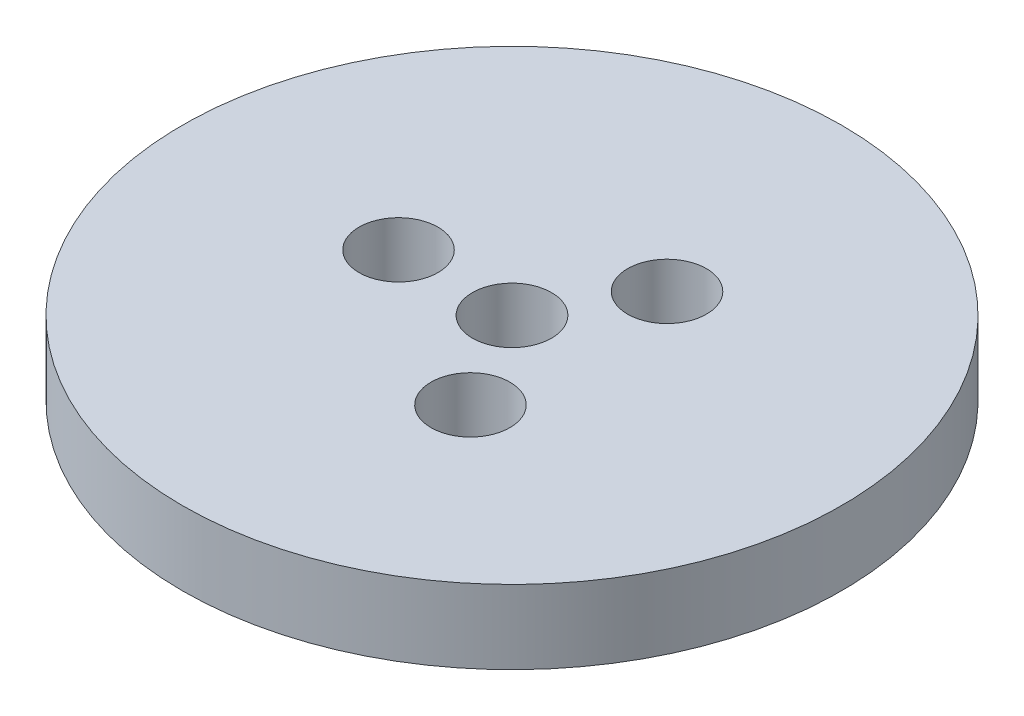
ISO-10303-21;
HEADER;
FILE_DESCRIPTION(('STEP AP214'),'2;1');
FILE_NAME('part.step','',(''),(''),'','','');
FILE_SCHEMA(('AUTOMOTIVE_DESIGN { 1 0 10303 214 1 1 1 1 }'));
ENDSEC;
DATA;
#1=APPLICATION_CONTEXT('core data for automotive mechanical design processes');
#2=APPLICATION_PROTOCOL_DEFINITION('international standard','automotive_design',2000,#1);
#3=PRODUCT_CONTEXT('',#1,'mechanical');
#4=PRODUCT('Part','Part','',(#3));
#5=PRODUCT_RELATED_PRODUCT_CATEGORY('part','',(#4));
#6=PRODUCT_DEFINITION_FORMATION('','',#4);
#7=PRODUCT_DEFINITION_CONTEXT('part definition',#1,'design');
#8=PRODUCT_DEFINITION('design','',#6,#7);
#9=PRODUCT_DEFINITION_SHAPE('','',#8);
#10=(LENGTH_UNIT() NAMED_UNIT(*) SI_UNIT(.MILLI.,.METRE.));
#11=(NAMED_UNIT(*) PLANE_ANGLE_UNIT() SI_UNIT($,.RADIAN.));
#12=(NAMED_UNIT(*) SI_UNIT($,.STERADIAN.) SOLID_ANGLE_UNIT());
#13=UNCERTAINTY_MEASURE_WITH_UNIT(LENGTH_MEASURE(1.E-05),#10,'distance_accuracy_value','');
#14=(GEOMETRIC_REPRESENTATION_CONTEXT(3) GLOBAL_UNCERTAINTY_ASSIGNED_CONTEXT((#13)) GLOBAL_UNIT_ASSIGNED_CONTEXT((#10,
#11,#12)) REPRESENTATION_CONTEXT('',''));
#15=CARTESIAN_POINT('',(0.,0.,0.));
#16=DIRECTION('',(0.,0.,1.));
#17=DIRECTION('',(1.,0.,0.));
#18=AXIS2_PLACEMENT_3D('',#15,#16,#17);
#19=CARTESIAN_POINT('',(0.,14.,0.));
#20=DIRECTION('',(0.,-1.,0.));
#21=DIRECTION('',(0.,0.,-1.));
#22=AXIS2_PLACEMENT_3D('',#19,#20,#21);
#23=CYLINDRICAL_SURFACE('',#22,62.5);
#24=CARTESIAN_POINT('',(0.,14.,0.));
#25=DIRECTION('',(0.,1.,0.));
#26=DIRECTION('',(0.,0.,1.));
#27=AXIS2_PLACEMENT_3D('',#24,#25,#26);
#28=CIRCLE('',#27,62.5);
#29=CARTESIAN_POINT('',(0.,14.,62.5));
#30=VERTEX_POINT('',#29);
#31=EDGE_CURVE('E10',#30,#30,#28,.T.);
#32=ORIENTED_EDGE('',*,*,#31,.F.);
#33=EDGE_LOOP('',(#32));
#34=FACE_BOUND('',#33,.T.);
#35=CARTESIAN_POINT('',(0.,0.,0.));
#36=DIRECTION('',(0.,1.,0.));
#37=DIRECTION('',(0.,0.,1.));
#38=AXIS2_PLACEMENT_3D('',#35,#36,#37);
#39=CIRCLE('',#38,62.5);
#40=CARTESIAN_POINT('',(0.,0.,62.5));
#41=VERTEX_POINT('',#40);
#42=EDGE_CURVE('E37',#41,#41,#39,.T.);
#43=ORIENTED_EDGE('',*,*,#42,.T.);
#44=EDGE_LOOP('',(#43));
#45=FACE_BOUND('',#44,.T.);
#46=ADVANCED_FACE('F40',(#34,#45),#23,.T.);
#47=CARTESIAN_POINT('',(0.,14.,0.));
#48=DIRECTION('',(0.,1.,0.));
#49=DIRECTION('',(0.,0.,1.));
#50=AXIS2_PLACEMENT_3D('',#47,#48,#49);
#51=PLANE('',#50);
#52=CARTESIAN_POINT('',(10.7622114513418,14.,18.6406970355233));
#53=DIRECTION('',(0.,1.,0.));
#54=DIRECTION('',(0.866025403784436,0.,-0.500000000000004));
#55=AXIS2_PLACEMENT_3D('',#52,#53,#54);
#56=CIRCLE('',#55,7.48312621691386);
#57=CARTESIAN_POINT('',(10.7622114513418,14.,26.1238232524372));
#58=VERTEX_POINT('',#57);
#59=EDGE_CURVE('E70',#58,#58,#56,.T.);
#60=ORIENTED_EDGE('',*,*,#59,.F.);
#61=EDGE_LOOP('',(#60));
#62=FACE_BOUND('',#61,.T.);
#63=CARTESIAN_POINT('',(10.7622114513415,14.,-18.6406970355235));
#64=DIRECTION('',(0.,1.,0.));
#65=DIRECTION('',(-0.866025403784443,0.,-0.499999999999992));
#66=AXIS2_PLACEMENT_3D('',#63,#64,#65);
#67=CIRCLE('',#66,7.48312621691386);
#68=CARTESIAN_POINT('',(10.7622114513415,14.,-11.1575708186096));
#69=VERTEX_POINT('',#68);
#70=EDGE_CURVE('E61',#69,#69,#67,.T.);
#71=ORIENTED_EDGE('',*,*,#70,.F.);
#72=EDGE_LOOP('',(#71));
#73=FACE_BOUND('',#72,.T.);
#74=CARTESIAN_POINT('',(-21.5244229026834,14.,0.));
#75=DIRECTION('',(0.,1.,0.));
#76=DIRECTION('',(0.,0.,1.));
#77=AXIS2_PLACEMENT_3D('',#74,#75,#76);
#78=CIRCLE('',#77,7.48312621691386);
#79=CARTESIAN_POINT('',(-21.5244229026834,14.,7.48312621691386));
#80=VERTEX_POINT('',#79);
#81=EDGE_CURVE('E54',#80,#80,#78,.T.);
#82=ORIENTED_EDGE('',*,*,#81,.F.);
#83=EDGE_LOOP('',(#82));
#84=FACE_BOUND('',#83,.T.);
#85=CARTESIAN_POINT('',(0.,14.,0.));
#86=DIRECTION('',(0.,1.,0.));
#87=DIRECTION('',(0.,0.,1.));
#88=AXIS2_PLACEMENT_3D('',#85,#86,#87);
#89=CIRCLE('',#88,7.5);
#90=CARTESIAN_POINT('',(0.,14.,7.5));
#91=VERTEX_POINT('',#90);
#92=EDGE_CURVE('E50',#91,#91,#89,.T.);
#93=ORIENTED_EDGE('',*,*,#92,.F.);
#94=EDGE_LOOP('',(#93));
#95=FACE_BOUND('',#94,.T.);
#96=ORIENTED_EDGE('',*,*,#31,.T.);
#97=EDGE_LOOP('',(#96));
#98=FACE_BOUND('',#97,.T.);
#99=ADVANCED_FACE('F85',(#62,#73,#84,#95,#98),#51,.T.);
#100=CARTESIAN_POINT('',(0.,0.,0.));
#101=DIRECTION('',(0.,1.,0.));
#102=DIRECTION('',(0.,0.,1.));
#103=AXIS2_PLACEMENT_3D('',#100,#101,#102);
#104=PLANE('',#103);
#105=CARTESIAN_POINT('',(0.,0.,0.));
#106=DIRECTION('',(0.,1.,0.));
#107=DIRECTION('',(0.,0.,1.));
#108=AXIS2_PLACEMENT_3D('',#105,#106,#107);
#109=CIRCLE('',#108,7.5);
#110=CARTESIAN_POINT('',(0.,0.,7.5));
#111=VERTEX_POINT('',#110);
#112=EDGE_CURVE('E47',#111,#111,#109,.T.);
#113=ORIENTED_EDGE('',*,*,#112,.T.);
#114=EDGE_LOOP('',(#113));
#115=FACE_BOUND('',#114,.T.);
#116=ORIENTED_EDGE('',*,*,#42,.F.);
#117=EDGE_LOOP('',(#116));
#118=FACE_BOUND('',#117,.T.);
#119=ADVANCED_FACE('F84',(#115,#118),#104,.F.);
#120=CARTESIAN_POINT('',(0.,14.,0.));
#121=DIRECTION('',(0.,-1.,0.));
#122=DIRECTION('',(0.,0.,-1.));
#123=AXIS2_PLACEMENT_3D('',#120,#121,#122);
#124=CYLINDRICAL_SURFACE('',#123,7.5);
#125=ORIENTED_EDGE('',*,*,#92,.T.);
#126=EDGE_LOOP('',(#125));
#127=FACE_BOUND('',#126,.T.);
#128=ORIENTED_EDGE('',*,*,#112,.F.);
#129=EDGE_LOOP('',(#128));
#130=FACE_BOUND('',#129,.T.);
#131=ADVANCED_FACE('F91',(#127,#130),#124,.F.);
#132=CARTESIAN_POINT('',(-21.5244229026834,0.99956611912721,0.));
#133=DIRECTION('',(0.,1.,0.));
#134=DIRECTION('',(0.,0.,1.));
#135=AXIS2_PLACEMENT_3D('',#132,#133,#134);
#136=CYLINDRICAL_SURFACE('',#135,7.48312621691386);
#137=CARTESIAN_POINT('',(-21.5244229026834,0.99956611912721,0.));
#138=DIRECTION('',(0.,1.,0.));
#139=DIRECTION('',(0.,0.,1.));
#140=AXIS2_PLACEMENT_3D('',#137,#138,#139);
#141=CIRCLE('',#140,7.48312621691386);
#142=CARTESIAN_POINT('',(-21.5244229026834,0.99956611912721,7.48312621691386));
#143=VERTEX_POINT('',#142);
#144=EDGE_CURVE('E55',#143,#143,#141,.T.);
#145=CARTESIAN_POINT('',(-21.5244229026834,0.99956611912721,7.48312621691386));
#146=CARTESIAN_POINT('',(-21.5244229026834,1.1349873053863,7.48312621691386));
#147=CARTESIAN_POINT('',(-21.5244229026834,1.27040849164539,7.48312621691386));
#148=CARTESIAN_POINT('',(-21.5244229026834,1.54125086416358,7.48312621691386));
#149=CARTESIAN_POINT('',(-21.5244229026834,1.67667205042267,7.48312621691386));
#150=CARTESIAN_POINT('',(-21.5244229026834,1.94751442294085,7.48312621691386));
#151=CARTESIAN_POINT('',(-21.5244229026834,2.08293560919994,7.48312621691386));
#152=CARTESIAN_POINT('',(-21.5244229026834,2.35377798171813,7.48312621691386));
#153=CARTESIAN_POINT('',(-21.5244229026834,2.48919916797722,7.48312621691386));
#154=CARTESIAN_POINT('',(-21.5244229026834,2.7600415404954,7.48312621691386));
#155=CARTESIAN_POINT('',(-21.5244229026834,2.89546272675449,7.48312621691386));
#156=CARTESIAN_POINT('',(-21.5244229026834,3.16630509927267,7.48312621691386));
#157=CARTESIAN_POINT('',(-21.5244229026834,3.30172628553177,7.48312621691386));
#158=CARTESIAN_POINT('',(-21.5244229026834,3.57256865804995,7.48312621691386));
#159=CARTESIAN_POINT('',(-21.5244229026834,3.70798984430904,7.48312621691386));
#160=CARTESIAN_POINT('',(-21.5244229026834,3.97883221682722,7.48312621691386));
#161=CARTESIAN_POINT('',(-21.5244229026834,4.11425340308632,7.48312621691386));
#162=CARTESIAN_POINT('',(-21.5244229026834,4.3850957756045,7.48312621691386));
#163=CARTESIAN_POINT('',(-21.5244229026834,4.52051696186359,7.48312621691386));
#164=CARTESIAN_POINT('',(-21.5244229026834,4.79135933438177,7.48312621691386));
#165=CARTESIAN_POINT('',(-21.5244229026834,4.92678052064086,7.48312621691386));
#166=CARTESIAN_POINT('',(-21.5244229026834,5.19762289315905,7.48312621691386));
#167=CARTESIAN_POINT('',(-21.5244229026834,5.33304407941814,7.48312621691386));
#168=CARTESIAN_POINT('',(-21.5244229026834,5.60388645193632,7.48312621691386));
#169=CARTESIAN_POINT('',(-21.5244229026834,5.73930763819541,7.48312621691386));
#170=CARTESIAN_POINT('',(-21.5244229026834,6.0101500107136,7.48312621691386));
#171=CARTESIAN_POINT('',(-21.5244229026834,6.14557119697269,7.48312621691386));
#172=CARTESIAN_POINT('',(-21.5244229026834,6.41641356949087,7.48312621691386));
#173=CARTESIAN_POINT('',(-21.5244229026834,6.55183475574996,7.48312621691386));
#174=CARTESIAN_POINT('',(-21.5244229026834,6.82267712826815,7.48312621691386));
#175=CARTESIAN_POINT('',(-21.5244229026834,6.95809831452724,7.48312621691386));
#176=CARTESIAN_POINT('',(-21.5244229026834,7.22894068704542,7.48312621691386));
#177=CARTESIAN_POINT('',(-21.5244229026834,7.36436187330451,7.48312621691386));
#178=CARTESIAN_POINT('',(-21.5244229026834,7.6352042458227,7.48312621691386));
#179=CARTESIAN_POINT('',(-21.5244229026834,7.77062543208179,7.48312621691386));
#180=CARTESIAN_POINT('',(-21.5244229026834,8.04146780459997,7.48312621691386));
#181=CARTESIAN_POINT('',(-21.5244229026834,8.17688899085906,7.48312621691386));
#182=CARTESIAN_POINT('',(-21.5244229026834,8.44773136337725,7.48312621691386));
#183=CARTESIAN_POINT('',(-21.5244229026834,8.58315254963634,7.48312621691386));
#184=CARTESIAN_POINT('',(-21.5244229026834,8.85399492215452,7.48312621691386));
#185=CARTESIAN_POINT('',(-21.5244229026834,8.98941610841361,7.48312621691386));
#186=CARTESIAN_POINT('',(-21.5244229026834,9.26025848093179,7.48312621691386));
#187=CARTESIAN_POINT('',(-21.5244229026834,9.39567966719089,7.48312621691386));
#188=CARTESIAN_POINT('',(-21.5244229026834,9.66652203970907,7.48312621691386));
#189=CARTESIAN_POINT('',(-21.5244229026834,9.80194322596816,7.48312621691386));
#190=CARTESIAN_POINT('',(-21.5244229026834,10.0727855984863,7.48312621691386));
#191=CARTESIAN_POINT('',(-21.5244229026834,10.2082067847454,7.48312621691386));
#192=CARTESIAN_POINT('',(-21.5244229026834,10.4790491572636,7.48312621691386));
#193=CARTESIAN_POINT('',(-21.5244229026834,10.6144703435227,7.48312621691386));
#194=CARTESIAN_POINT('',(-21.5244229026834,10.8853127160409,7.48312621691386));
#195=CARTESIAN_POINT('',(-21.5244229026834,11.0207339023,7.48312621691386));
#196=CARTESIAN_POINT('',(-21.5244229026834,11.2915762748182,7.48312621691386));
#197=CARTESIAN_POINT('',(-21.5244229026834,11.4269974610773,7.48312621691386));
#198=CARTESIAN_POINT('',(-21.5244229026834,11.6978398335954,7.48312621691386));
#199=CARTESIAN_POINT('',(-21.5244229026834,11.8332610198545,7.48312621691386));
#200=CARTESIAN_POINT('',(-21.5244229026834,12.1041033923727,7.48312621691386));
#201=CARTESIAN_POINT('',(-21.5244229026834,12.2395245786318,7.48312621691386));
#202=CARTESIAN_POINT('',(-21.5244229026834,12.51036695115,7.48312621691386));
#203=CARTESIAN_POINT('',(-21.5244229026834,12.6457881374091,7.48312621691386));
#204=CARTESIAN_POINT('',(-21.5244229026834,12.9166305099273,7.48312621691386));
#205=CARTESIAN_POINT('',(-21.5244229026834,13.0520516961864,7.48312621691386));
#206=CARTESIAN_POINT('',(-21.5244229026834,13.3228940687045,7.48312621691386));
#207=CARTESIAN_POINT('',(-21.5244229026834,13.4583152549636,7.48312621691386));
#208=CARTESIAN_POINT('',(-21.5244229026834,13.7291576274818,7.48312621691386));
#209=CARTESIAN_POINT('',(-21.5244229026834,13.8645788137409,7.48312621691386));
#210=CARTESIAN_POINT('',(-21.5244229026834,14.,7.48312621691386));
#211=B_SPLINE_CURVE_WITH_KNOTS('',3,(#145,#146,#147,#148,#149,#150,#151,#152,#153,#154,#155,
#156,#157,#158,#159,#160,#161,#162,#163,#164,#165,#166,#167,#168,#169,#170,#171,#172,#173,#174,
#175,#176,#177,#178,#179,#180,#181,#182,#183,#184,#185,#186,#187,#188,#189,#190,#191,#192,#193,
#194,#195,#196,#197,#198,#199,#200,#201,#202,#203,#204,#205,#206,#207,#208,#209,#210),
.UNSPECIFIED.,.F.,.F.,(4,2,2,2,2,2,2,2,2,2,2,2,2,2,2,2,2,2,2,2,2,2,2,2,2,2,2,2,2,2,2,2,4),(0.,
0.406263558777274,0.812527117554549,1.21879067633182,1.6250542351091,2.03131779388637,
2.43758135266365,2.84384491144092,3.2501084702182,3.65637202899547,4.06263558777275,
4.46889914655002,4.8751627053273,5.28142626410457,5.68768982288184,6.09395338165912,
6.50021694043639,6.90648049921367,7.31274405799094,7.71900761676822,8.12527117554549,
8.53153473432277,8.93779829310004,9.34406185187732,9.75032541065459,10.1565889694319,
10.5628525282091,10.9691160869864,11.3753796457637,11.781643204541,12.1879067633182,
12.5941703220955,13.0004338808728),.UNSPECIFIED.);
#212=EDGE_CURVE('BSEAM96',#143,#80,#211,.T.);
#213=ORIENTED_EDGE('',*,*,#144,.F.);
#214=ORIENTED_EDGE('',*,*,#81,.T.);
#215=ORIENTED_EDGE('',*,*,#212,.T.);
#216=ORIENTED_EDGE('',*,*,#212,.F.);
#217=EDGE_LOOP('',(#213,#215,#214,#216));
#218=FACE_BOUND('',#217,.T.);
#219=ADVANCED_FACE('F96',(#218),#136,.F.);
#220=CARTESIAN_POINT('',(-21.5244229026834,0.99956611912721,0.));
#221=DIRECTION('',(0.,1.,0.));
#222=DIRECTION('',(0.,0.,1.));
#223=AXIS2_PLACEMENT_3D('',#220,#221,#222);
#224=PLANE('',#223);
#225=ORIENTED_EDGE('',*,*,#144,.T.);
#226=EDGE_LOOP('',(#225));
#227=FACE_BOUND('',#226,.T.);
#228=ADVANCED_FACE('F127',(#227),#224,.T.);
#229=CARTESIAN_POINT('',(10.7622114513415,0.99956611912721,-18.6406970355235));
#230=DIRECTION('',(0.,1.,0.));
#231=DIRECTION('',(0.,0.,1.));
#232=AXIS2_PLACEMENT_3D('',#229,#230,#231);
#233=CYLINDRICAL_SURFACE('',#232,7.48312621691386);
#234=CARTESIAN_POINT('',(10.7622114513415,0.99956611912721,-18.6406970355235));
#235=DIRECTION('',(0.,1.,0.));
#236=DIRECTION('',(-0.866025403784443,0.,-0.499999999999992));
#237=AXIS2_PLACEMENT_3D('',#234,#235,#236);
#238=CIRCLE('',#237,7.48312621691386);
#239=CARTESIAN_POINT('',(10.7622114513415,0.99956611912721,-11.1575708186096));
#240=VERTEX_POINT('',#239);
#241=EDGE_CURVE('E63',#240,#240,#238,.T.);
#242=CARTESIAN_POINT('',(10.7622114513415,0.99956611912721,-11.1575708186096));
#243=CARTESIAN_POINT('',(10.7622114513415,1.1349873053863,-11.1575708186096));
#244=CARTESIAN_POINT('',(10.7622114513415,1.27040849164539,-11.1575708186096));
#245=CARTESIAN_POINT('',(10.7622114513415,1.54125086416358,-11.1575708186096));
#246=CARTESIAN_POINT('',(10.7622114513415,1.67667205042267,-11.1575708186096));
#247=CARTESIAN_POINT('',(10.7622114513415,1.94751442294085,-11.1575708186096));
#248=CARTESIAN_POINT('',(10.7622114513415,2.08293560919994,-11.1575708186096));
#249=CARTESIAN_POINT('',(10.7622114513415,2.35377798171813,-11.1575708186096));
#250=CARTESIAN_POINT('',(10.7622114513415,2.48919916797722,-11.1575708186096));
#251=CARTESIAN_POINT('',(10.7622114513415,2.7600415404954,-11.1575708186096));
#252=CARTESIAN_POINT('',(10.7622114513415,2.89546272675449,-11.1575708186096));
#253=CARTESIAN_POINT('',(10.7622114513415,3.16630509927267,-11.1575708186096));
#254=CARTESIAN_POINT('',(10.7622114513415,3.30172628553177,-11.1575708186096));
#255=CARTESIAN_POINT('',(10.7622114513415,3.57256865804995,-11.1575708186096));
#256=CARTESIAN_POINT('',(10.7622114513415,3.70798984430904,-11.1575708186096));
#257=CARTESIAN_POINT('',(10.7622114513415,3.97883221682722,-11.1575708186096));
#258=CARTESIAN_POINT('',(10.7622114513415,4.11425340308632,-11.1575708186096));
#259=CARTESIAN_POINT('',(10.7622114513415,4.3850957756045,-11.1575708186096));
#260=CARTESIAN_POINT('',(10.7622114513415,4.52051696186359,-11.1575708186096));
#261=CARTESIAN_POINT('',(10.7622114513415,4.79135933438177,-11.1575708186096));
#262=CARTESIAN_POINT('',(10.7622114513415,4.92678052064086,-11.1575708186096));
#263=CARTESIAN_POINT('',(10.7622114513415,5.19762289315905,-11.1575708186096));
#264=CARTESIAN_POINT('',(10.7622114513415,5.33304407941814,-11.1575708186096));
#265=CARTESIAN_POINT('',(10.7622114513415,5.60388645193632,-11.1575708186096));
#266=CARTESIAN_POINT('',(10.7622114513415,5.73930763819541,-11.1575708186096));
#267=CARTESIAN_POINT('',(10.7622114513415,6.0101500107136,-11.1575708186096));
#268=CARTESIAN_POINT('',(10.7622114513415,6.14557119697269,-11.1575708186096));
#269=CARTESIAN_POINT('',(10.7622114513415,6.41641356949087,-11.1575708186096));
#270=CARTESIAN_POINT('',(10.7622114513415,6.55183475574996,-11.1575708186096));
#271=CARTESIAN_POINT('',(10.7622114513415,6.82267712826815,-11.1575708186096));
#272=CARTESIAN_POINT('',(10.7622114513415,6.95809831452724,-11.1575708186096));
#273=CARTESIAN_POINT('',(10.7622114513415,7.22894068704542,-11.1575708186096));
#274=CARTESIAN_POINT('',(10.7622114513415,7.36436187330451,-11.1575708186096));
#275=CARTESIAN_POINT('',(10.7622114513415,7.6352042458227,-11.1575708186096));
#276=CARTESIAN_POINT('',(10.7622114513415,7.77062543208179,-11.1575708186096));
#277=CARTESIAN_POINT('',(10.7622114513415,8.04146780459997,-11.1575708186096));
#278=CARTESIAN_POINT('',(10.7622114513415,8.17688899085906,-11.1575708186096));
#279=CARTESIAN_POINT('',(10.7622114513415,8.44773136337725,-11.1575708186096));
#280=CARTESIAN_POINT('',(10.7622114513415,8.58315254963634,-11.1575708186096));
#281=CARTESIAN_POINT('',(10.7622114513415,8.85399492215452,-11.1575708186096));
#282=CARTESIAN_POINT('',(10.7622114513415,8.98941610841361,-11.1575708186096));
#283=CARTESIAN_POINT('',(10.7622114513415,9.26025848093179,-11.1575708186096));
#284=CARTESIAN_POINT('',(10.7622114513415,9.39567966719089,-11.1575708186096));
#285=CARTESIAN_POINT('',(10.7622114513415,9.66652203970907,-11.1575708186096));
#286=CARTESIAN_POINT('',(10.7622114513415,9.80194322596816,-11.1575708186096));
#287=CARTESIAN_POINT('',(10.7622114513415,10.0727855984863,-11.1575708186096));
#288=CARTESIAN_POINT('',(10.7622114513415,10.2082067847454,-11.1575708186096));
#289=CARTESIAN_POINT('',(10.7622114513415,10.4790491572636,-11.1575708186096));
#290=CARTESIAN_POINT('',(10.7622114513415,10.6144703435227,-11.1575708186096));
#291=CARTESIAN_POINT('',(10.7622114513415,10.8853127160409,-11.1575708186096));
#292=CARTESIAN_POINT('',(10.7622114513415,11.0207339023,-11.1575708186096));
#293=CARTESIAN_POINT('',(10.7622114513415,11.2915762748182,-11.1575708186096));
#294=CARTESIAN_POINT('',(10.7622114513415,11.4269974610773,-11.1575708186096));
#295=CARTESIAN_POINT('',(10.7622114513415,11.6978398335954,-11.1575708186096));
#296=CARTESIAN_POINT('',(10.7622114513415,11.8332610198545,-11.1575708186096));
#297=CARTESIAN_POINT('',(10.7622114513415,12.1041033923727,-11.1575708186096));
#298=CARTESIAN_POINT('',(10.7622114513415,12.2395245786318,-11.1575708186096));
#299=CARTESIAN_POINT('',(10.7622114513415,12.51036695115,-11.1575708186096));
#300=CARTESIAN_POINT('',(10.7622114513415,12.6457881374091,-11.1575708186096));
#301=CARTESIAN_POINT('',(10.7622114513415,12.9166305099273,-11.1575708186096));
#302=CARTESIAN_POINT('',(10.7622114513415,13.0520516961864,-11.1575708186096));
#303=CARTESIAN_POINT('',(10.7622114513415,13.3228940687045,-11.1575708186096));
#304=CARTESIAN_POINT('',(10.7622114513415,13.4583152549636,-11.1575708186096));
#305=CARTESIAN_POINT('',(10.7622114513415,13.7291576274818,-11.1575708186096));
#306=CARTESIAN_POINT('',(10.7622114513415,13.8645788137409,-11.1575708186096));
#307=CARTESIAN_POINT('',(10.7622114513415,14.,-11.1575708186096));
#308=B_SPLINE_CURVE_WITH_KNOTS('',3,(#242,#243,#244,#245,#246,#247,#248,#249,#250,#251,#252,
#253,#254,#255,#256,#257,#258,#259,#260,#261,#262,#263,#264,#265,#266,#267,#268,#269,#270,#271,
#272,#273,#274,#275,#276,#277,#278,#279,#280,#281,#282,#283,#284,#285,#286,#287,#288,#289,#290,
#291,#292,#293,#294,#295,#296,#297,#298,#299,#300,#301,#302,#303,#304,#305,#306,#307),
.UNSPECIFIED.,.F.,.F.,(4,2,2,2,2,2,2,2,2,2,2,2,2,2,2,2,2,2,2,2,2,2,2,2,2,2,2,2,2,2,2,2,4),(0.,
0.406263558777274,0.812527117554549,1.21879067633182,1.6250542351091,2.03131779388637,
2.43758135266365,2.84384491144092,3.2501084702182,3.65637202899547,4.06263558777275,
4.46889914655002,4.8751627053273,5.28142626410457,5.68768982288184,6.09395338165912,
6.50021694043639,6.90648049921367,7.31274405799094,7.71900761676822,8.12527117554549,
8.53153473432277,8.93779829310004,9.34406185187732,9.75032541065459,10.1565889694319,
10.5628525282091,10.9691160869864,11.3753796457637,11.781643204541,12.1879067633182,
12.5941703220955,13.0004338808728),.UNSPECIFIED.);
#309=EDGE_CURVE('BSEAM133',#240,#69,#308,.T.);
#310=ORIENTED_EDGE('',*,*,#241,.F.);
#311=ORIENTED_EDGE('',*,*,#70,.T.);
#312=ORIENTED_EDGE('',*,*,#309,.T.);
#313=ORIENTED_EDGE('',*,*,#309,.F.);
#314=EDGE_LOOP('',(#310,#312,#311,#313));
#315=FACE_BOUND('',#314,.T.);
#316=ADVANCED_FACE('F133',(#315),#233,.F.);
#317=CARTESIAN_POINT('',(10.7622114513415,0.99956611912721,-18.6406970355235));
#318=DIRECTION('',(0.,1.,0.));
#319=DIRECTION('',(-0.866025403784443,0.,-0.499999999999992));
#320=AXIS2_PLACEMENT_3D('',#317,#318,#319);
#321=PLANE('',#320);
#322=ORIENTED_EDGE('',*,*,#241,.T.);
#323=EDGE_LOOP('',(#322));
#324=FACE_BOUND('',#323,.T.);
#325=ADVANCED_FACE('F77',(#324),#321,.T.);
#326=CARTESIAN_POINT('',(10.7622114513418,0.99956611912721,18.6406970355233));
#327=DIRECTION('',(0.,1.,0.));
#328=DIRECTION('',(0.,0.,1.));
#329=AXIS2_PLACEMENT_3D('',#326,#327,#328);
#330=CYLINDRICAL_SURFACE('',#329,7.48312621691386);
#331=CARTESIAN_POINT('',(10.7622114513418,0.99956611912721,18.6406970355233));
#332=DIRECTION('',(0.,1.,0.));
#333=DIRECTION('',(0.866025403784436,0.,-0.500000000000004));
#334=AXIS2_PLACEMENT_3D('',#331,#332,#333);
#335=CIRCLE('',#334,7.48312621691386);
#336=CARTESIAN_POINT('',(10.7622114513418,0.99956611912721,26.1238232524372));
#337=VERTEX_POINT('',#336);
#338=EDGE_CURVE('E59',#337,#337,#335,.T.);
#339=CARTESIAN_POINT('',(10.7622114513418,0.99956611912721,26.1238232524372));
#340=CARTESIAN_POINT('',(10.7622114513418,1.1349873053863,26.1238232524372));
#341=CARTESIAN_POINT('',(10.7622114513418,1.27040849164539,26.1238232524372));
#342=CARTESIAN_POINT('',(10.7622114513418,1.54125086416358,26.1238232524372));
#343=CARTESIAN_POINT('',(10.7622114513418,1.67667205042267,26.1238232524372));
#344=CARTESIAN_POINT('',(10.7622114513418,1.94751442294085,26.1238232524372));
#345=CARTESIAN_POINT('',(10.7622114513418,2.08293560919994,26.1238232524372));
#346=CARTESIAN_POINT('',(10.7622114513418,2.35377798171813,26.1238232524372));
#347=CARTESIAN_POINT('',(10.7622114513418,2.48919916797722,26.1238232524372));
#348=CARTESIAN_POINT('',(10.7622114513418,2.7600415404954,26.1238232524372));
#349=CARTESIAN_POINT('',(10.7622114513418,2.89546272675449,26.1238232524372));
#350=CARTESIAN_POINT('',(10.7622114513418,3.16630509927267,26.1238232524372));
#351=CARTESIAN_POINT('',(10.7622114513418,3.30172628553177,26.1238232524372));
#352=CARTESIAN_POINT('',(10.7622114513418,3.57256865804995,26.1238232524372));
#353=CARTESIAN_POINT('',(10.7622114513418,3.70798984430904,26.1238232524372));
#354=CARTESIAN_POINT('',(10.7622114513418,3.97883221682722,26.1238232524372));
#355=CARTESIAN_POINT('',(10.7622114513418,4.11425340308632,26.1238232524372));
#356=CARTESIAN_POINT('',(10.7622114513418,4.3850957756045,26.1238232524372));
#357=CARTESIAN_POINT('',(10.7622114513418,4.52051696186359,26.1238232524372));
#358=CARTESIAN_POINT('',(10.7622114513418,4.79135933438177,26.1238232524372));
#359=CARTESIAN_POINT('',(10.7622114513418,4.92678052064086,26.1238232524372));
#360=CARTESIAN_POINT('',(10.7622114513418,5.19762289315905,26.1238232524372));
#361=CARTESIAN_POINT('',(10.7622114513418,5.33304407941814,26.1238232524372));
#362=CARTESIAN_POINT('',(10.7622114513418,5.60388645193632,26.1238232524372));
#363=CARTESIAN_POINT('',(10.7622114513418,5.73930763819541,26.1238232524372));
#364=CARTESIAN_POINT('',(10.7622114513418,6.0101500107136,26.1238232524372));
#365=CARTESIAN_POINT('',(10.7622114513418,6.14557119697269,26.1238232524372));
#366=CARTESIAN_POINT('',(10.7622114513418,6.41641356949087,26.1238232524372));
#367=CARTESIAN_POINT('',(10.7622114513418,6.55183475574996,26.1238232524372));
#368=CARTESIAN_POINT('',(10.7622114513418,6.82267712826815,26.1238232524372));
#369=CARTESIAN_POINT('',(10.7622114513418,6.95809831452724,26.1238232524372));
#370=CARTESIAN_POINT('',(10.7622114513418,7.22894068704542,26.1238232524372));
#371=CARTESIAN_POINT('',(10.7622114513418,7.36436187330451,26.1238232524372));
#372=CARTESIAN_POINT('',(10.7622114513418,7.6352042458227,26.1238232524372));
#373=CARTESIAN_POINT('',(10.7622114513418,7.77062543208179,26.1238232524372));
#374=CARTESIAN_POINT('',(10.7622114513418,8.04146780459997,26.1238232524372));
#375=CARTESIAN_POINT('',(10.7622114513418,8.17688899085906,26.1238232524372));
#376=CARTESIAN_POINT('',(10.7622114513418,8.44773136337725,26.1238232524372));
#377=CARTESIAN_POINT('',(10.7622114513418,8.58315254963634,26.1238232524372));
#378=CARTESIAN_POINT('',(10.7622114513418,8.85399492215452,26.1238232524372));
#379=CARTESIAN_POINT('',(10.7622114513418,8.98941610841361,26.1238232524372));
#380=CARTESIAN_POINT('',(10.7622114513418,9.26025848093179,26.1238232524372));
#381=CARTESIAN_POINT('',(10.7622114513418,9.39567966719089,26.1238232524372));
#382=CARTESIAN_POINT('',(10.7622114513418,9.66652203970907,26.1238232524372));
#383=CARTESIAN_POINT('',(10.7622114513418,9.80194322596816,26.1238232524372));
#384=CARTESIAN_POINT('',(10.7622114513418,10.0727855984863,26.1238232524372));
#385=CARTESIAN_POINT('',(10.7622114513418,10.2082067847454,26.1238232524372));
#386=CARTESIAN_POINT('',(10.7622114513418,10.4790491572636,26.1238232524372));
#387=CARTESIAN_POINT('',(10.7622114513418,10.6144703435227,26.1238232524372));
#388=CARTESIAN_POINT('',(10.7622114513418,10.8853127160409,26.1238232524372));
#389=CARTESIAN_POINT('',(10.7622114513418,11.0207339023,26.1238232524372));
#390=CARTESIAN_POINT('',(10.7622114513418,11.2915762748182,26.1238232524372));
#391=CARTESIAN_POINT('',(10.7622114513418,11.4269974610773,26.1238232524372));
#392=CARTESIAN_POINT('',(10.7622114513418,11.6978398335954,26.1238232524372));
#393=CARTESIAN_POINT('',(10.7622114513418,11.8332610198545,26.1238232524372));
#394=CARTESIAN_POINT('',(10.7622114513418,12.1041033923727,26.1238232524372));
#395=CARTESIAN_POINT('',(10.7622114513418,12.2395245786318,26.1238232524372));
#396=CARTESIAN_POINT('',(10.7622114513418,12.51036695115,26.1238232524372));
#397=CARTESIAN_POINT('',(10.7622114513418,12.6457881374091,26.1238232524372));
#398=CARTESIAN_POINT('',(10.7622114513418,12.9166305099273,26.1238232524372));
#399=CARTESIAN_POINT('',(10.7622114513418,13.0520516961864,26.1238232524372));
#400=CARTESIAN_POINT('',(10.7622114513418,13.3228940687045,26.1238232524372));
#401=CARTESIAN_POINT('',(10.7622114513418,13.4583152549636,26.1238232524372));
#402=CARTESIAN_POINT('',(10.7622114513418,13.7291576274818,26.1238232524372));
#403=CARTESIAN_POINT('',(10.7622114513418,13.8645788137409,26.1238232524372));
#404=CARTESIAN_POINT('',(10.7622114513418,14.,26.1238232524372));
#405=B_SPLINE_CURVE_WITH_KNOTS('',3,(#339,#340,#341,#342,#343,#344,#345,#346,#347,#348,#349,
#350,#351,#352,#353,#354,#355,#356,#357,#358,#359,#360,#361,#362,#363,#364,#365,#366,#367,#368,
#369,#370,#371,#372,#373,#374,#375,#376,#377,#378,#379,#380,#381,#382,#383,#384,#385,#386,#387,
#388,#389,#390,#391,#392,#393,#394,#395,#396,#397,#398,#399,#400,#401,#402,#403,#404),
.UNSPECIFIED.,.F.,.F.,(4,2,2,2,2,2,2,2,2,2,2,2,2,2,2,2,2,2,2,2,2,2,2,2,2,2,2,2,2,2,2,2,4),(0.,
0.406263558777274,0.812527117554549,1.21879067633182,1.6250542351091,2.03131779388637,
2.43758135266365,2.84384491144092,3.2501084702182,3.65637202899547,4.06263558777275,
4.46889914655002,4.8751627053273,5.28142626410457,5.68768982288184,6.09395338165912,
6.50021694043639,6.90648049921367,7.31274405799094,7.71900761676822,8.12527117554549,
8.53153473432277,8.93779829310004,9.34406185187732,9.75032541065459,10.1565889694319,
10.5628525282091,10.9691160869864,11.3753796457637,11.781643204541,12.1879067633182,
12.5941703220955,13.0004338808728),.UNSPECIFIED.);
#406=EDGE_CURVE('BSEAM73',#337,#58,#405,.T.);
#407=ORIENTED_EDGE('',*,*,#338,.F.);
#408=ORIENTED_EDGE('',*,*,#59,.T.);
#409=ORIENTED_EDGE('',*,*,#406,.T.);
#410=ORIENTED_EDGE('',*,*,#406,.F.);
#411=EDGE_LOOP('',(#407,#409,#408,#410));
#412=FACE_BOUND('',#411,.T.);
#413=ADVANCED_FACE('F73',(#412),#330,.F.);
#414=CARTESIAN_POINT('',(10.7622114513418,0.99956611912721,18.6406970355233));
#415=DIRECTION('',(0.,1.,0.));
#416=DIRECTION('',(0.866025403784436,0.,-0.500000000000004));
#417=AXIS2_PLACEMENT_3D('',#414,#415,#416);
#418=PLANE('',#417);
#419=ORIENTED_EDGE('',*,*,#338,.T.);
#420=EDGE_LOOP('',(#419));
#421=FACE_BOUND('',#420,.T.);
#422=ADVANCED_FACE('F71',(#421),#418,.T.);
#423=CLOSED_SHELL('',(#46,#99,#119,#131,#219,#228,#316,#325,#413,#422));
#424=MANIFOLD_SOLID_BREP('B2',#423);
#425=ADVANCED_BREP_SHAPE_REPRESENTATION('',(#18,#424),#14);
#426=SHAPE_DEFINITION_REPRESENTATION(#9,#425);
ENDSEC;
END-ISO-10303-21;
